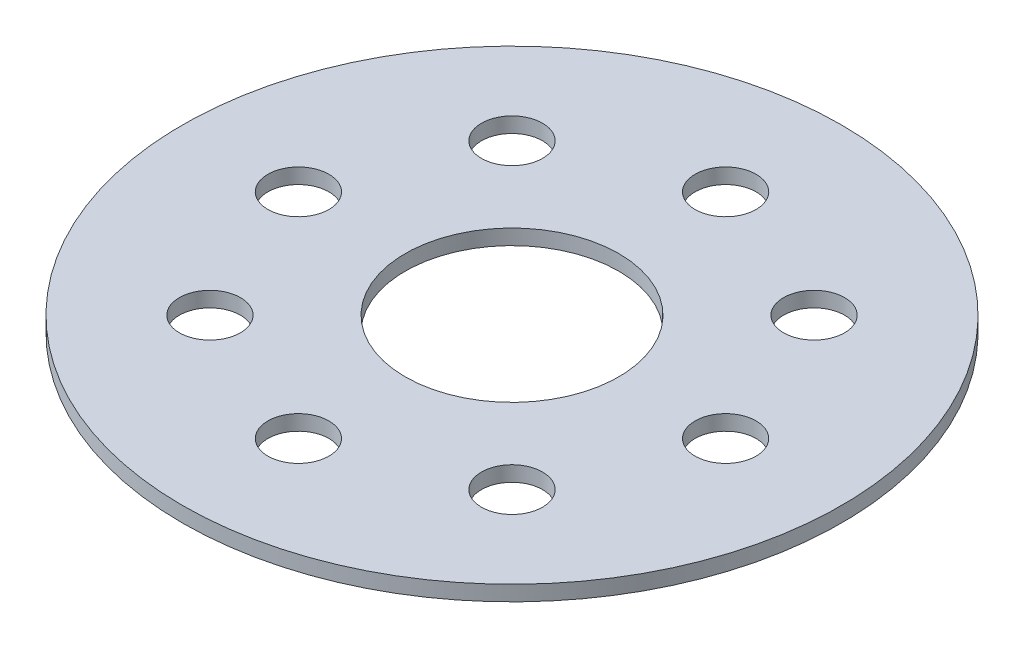
ISO-10303-21;
HEADER;
FILE_DESCRIPTION(('STEP AP214'),'2;1');
FILE_NAME('part.step','',(''),(''),'','','');
FILE_SCHEMA(('AUTOMOTIVE_DESIGN { 1 0 10303 214 1 1 1 1 }'));
ENDSEC;
DATA;
#1=APPLICATION_CONTEXT('core data for automotive mechanical design processes');
#2=APPLICATION_PROTOCOL_DEFINITION('international standard','automotive_design',2000,#1);
#3=PRODUCT_CONTEXT('',#1,'mechanical');
#4=PRODUCT('Part','Part','',(#3));
#5=PRODUCT_RELATED_PRODUCT_CATEGORY('part','',(#4));
#6=PRODUCT_DEFINITION_FORMATION('','',#4);
#7=PRODUCT_DEFINITION_CONTEXT('part definition',#1,'design');
#8=PRODUCT_DEFINITION('design','',#6,#7);
#9=PRODUCT_DEFINITION_SHAPE('','',#8);
#10=(LENGTH_UNIT() NAMED_UNIT(*) SI_UNIT(.MILLI.,.METRE.));
#11=(NAMED_UNIT(*) PLANE_ANGLE_UNIT() SI_UNIT($,.RADIAN.));
#12=(NAMED_UNIT(*) SI_UNIT($,.STERADIAN.) SOLID_ANGLE_UNIT());
#13=UNCERTAINTY_MEASURE_WITH_UNIT(LENGTH_MEASURE(1.E-05),#10,'distance_accuracy_value','');
#14=(GEOMETRIC_REPRESENTATION_CONTEXT(3) GLOBAL_UNCERTAINTY_ASSIGNED_CONTEXT((#13)) GLOBAL_UNIT_ASSIGNED_CONTEXT((#10,
#11,#12)) REPRESENTATION_CONTEXT('',''));
#15=CARTESIAN_POINT('',(0.,0.,0.));
#16=DIRECTION('',(0.,0.,1.));
#17=DIRECTION('',(1.,0.,0.));
#18=AXIS2_PLACEMENT_3D('',#15,#16,#17);
#19=CARTESIAN_POINT('',(0.,3.175,0.));
#20=DIRECTION('',(0.,1.,0.));
#21=DIRECTION('',(0.,0.,1.));
#22=AXIS2_PLACEMENT_3D('',#19,#20,#21);
#23=PLANE('',#22);
#24=CARTESIAN_POINT('',(-44.45,3.175,1.55196345511577E-13));
#25=DIRECTION('',(0.,1.,0.));
#26=DIRECTION('',(1.,0.,0.));
#27=AXIS2_PLACEMENT_3D('',#24,#25,#26);
#28=CIRCLE('',#27,6.35);
#29=CARTESIAN_POINT('',(-38.1,3.175,1.33025439009923E-13));
#30=VERTEX_POINT('',#29);
#31=EDGE_CURVE('E89',#30,#30,#28,.T.);
#32=ORIENTED_EDGE('',*,*,#31,.F.);
#33=EDGE_LOOP('',(#32));
#34=FACE_BOUND('',#33,.T.);
#35=CARTESIAN_POINT('',(-31.4308964237419,3.175,31.4308964237422));
#36=DIRECTION('',(0.,1.,0.));
#37=DIRECTION('',(0.707106781186544,0.,-0.707106781186551));
#38=AXIS2_PLACEMENT_3D('',#35,#36,#37);
#39=CIRCLE('',#38,6.35);
#40=CARTESIAN_POINT('',(-26.9407683632073,3.175,26.9407683632076));
#41=VERTEX_POINT('',#40);
#42=EDGE_CURVE('E83',#41,#41,#39,.T.);
#43=ORIENTED_EDGE('',*,*,#42,.F.);
#44=EDGE_LOOP('',(#43));
#45=FACE_BOUND('',#44,.T.);
#46=CARTESIAN_POINT('',(0.,3.175,44.45));
#47=DIRECTION('',(0.,1.,0.));
#48=DIRECTION('',(0.,0.,-1.));
#49=AXIS2_PLACEMENT_3D('',#46,#47,#48);
#50=CIRCLE('',#49,6.35);
#51=CARTESIAN_POINT('',(0.,3.175,38.1));
#52=VERTEX_POINT('',#51);
#53=EDGE_CURVE('E77',#52,#52,#50,.T.);
#54=ORIENTED_EDGE('',*,*,#53,.F.);
#55=EDGE_LOOP('',(#54));
#56=FACE_BOUND('',#55,.T.);
#57=CARTESIAN_POINT('',(31.4308964237423,3.175,31.4308964237418));
#58=DIRECTION('',(0.,1.,0.));
#59=DIRECTION('',(-0.707106781186554,0.,-0.707106781186541));
#60=AXIS2_PLACEMENT_3D('',#57,#58,#59);
#61=CIRCLE('',#60,6.35);
#62=CARTESIAN_POINT('',(26.9407683632077,3.175,26.9407683632072));
#63=VERTEX_POINT('',#62);
#64=EDGE_CURVE('E70',#63,#63,#61,.T.);
#65=ORIENTED_EDGE('',*,*,#64,.F.);
#66=EDGE_LOOP('',(#65));
#67=FACE_BOUND('',#66,.T.);
#68=CARTESIAN_POINT('',(44.45,3.175,-4.65589036534732E-13));
#69=DIRECTION('',(0.,1.,0.));
#70=DIRECTION('',(-1.,0.,0.));
#71=AXIS2_PLACEMENT_3D('',#68,#69,#70);
#72=CIRCLE('',#71,6.35);
#73=CARTESIAN_POINT('',(38.1,3.175,-3.9907631702977E-13));
#74=VERTEX_POINT('',#73);
#75=EDGE_CURVE('E100',#74,#74,#72,.T.);
#76=ORIENTED_EDGE('',*,*,#75,.F.);
#77=EDGE_LOOP('',(#76));
#78=FACE_BOUND('',#77,.T.);
#79=CARTESIAN_POINT('',(31.4308964237417,3.175,-31.4308964237424));
#80=DIRECTION('',(0.,1.,0.));
#81=DIRECTION('',(-0.707106781186539,0.,0.707106781186556));
#82=AXIS2_PLACEMENT_3D('',#79,#80,#81);
#83=CIRCLE('',#82,6.35);
#84=CARTESIAN_POINT('',(26.9407683632071,3.175,-26.9407683632078));
#85=VERTEX_POINT('',#84);
#86=EDGE_CURVE('E94',#85,#85,#83,.T.);
#87=ORIENTED_EDGE('',*,*,#86,.F.);
#88=EDGE_LOOP('',(#87));
#89=FACE_BOUND('',#88,.T.);
#90=CARTESIAN_POINT('',(-31.4308964237421,3.175,-31.430896423742));
#91=DIRECTION('',(0.,1.,0.));
#92=DIRECTION('',(0.707106781186549,0.,0.707106781186546));
#93=AXIS2_PLACEMENT_3D('',#90,#91,#92);
#94=CIRCLE('',#93,6.35);
#95=CARTESIAN_POINT('',(-26.9407683632075,3.175,-26.9407683632074));
#96=VERTEX_POINT('',#95);
#97=EDGE_CURVE('E64',#96,#96,#94,.T.);
#98=ORIENTED_EDGE('',*,*,#97,.F.);
#99=EDGE_LOOP('',(#98));
#100=FACE_BOUND('',#99,.T.);
#101=CARTESIAN_POINT('',(0.,3.175,-44.45));
#102=DIRECTION('',(0.,1.,0.));
#103=DIRECTION('',(0.,0.,1.));
#104=AXIS2_PLACEMENT_3D('',#101,#102,#103);
#105=CIRCLE('',#104,6.35);
#106=CARTESIAN_POINT('',(0.,3.175,-38.1));
#107=VERTEX_POINT('',#106);
#108=EDGE_CURVE('E58',#107,#107,#105,.T.);
#109=ORIENTED_EDGE('',*,*,#108,.F.);
#110=EDGE_LOOP('',(#109));
#111=FACE_BOUND('',#110,.T.);
#112=CARTESIAN_POINT('',(0.,3.175,0.));
#113=DIRECTION('',(0.,1.,0.));
#114=DIRECTION('',(0.,0.,1.));
#115=AXIS2_PLACEMENT_3D('',#112,#113,#114);
#116=CIRCLE('',#115,68.58);
#117=CARTESIAN_POINT('',(0.,3.175,68.58));
#118=VERTEX_POINT('',#117);
#119=EDGE_CURVE('E10',#118,#118,#116,.T.);
#120=ORIENTED_EDGE('',*,*,#119,.T.);
#121=EDGE_LOOP('',(#120));
#122=FACE_BOUND('',#121,.T.);
#123=CARTESIAN_POINT('',(0.,3.175,0.));
#124=DIRECTION('',(0.,1.,0.));
#125=DIRECTION('',(0.,0.,1.));
#126=AXIS2_PLACEMENT_3D('',#123,#124,#125);
#127=CIRCLE('',#126,22.225);
#128=CARTESIAN_POINT('',(0.,3.175,22.225));
#129=VERTEX_POINT('',#128);
#130=EDGE_CURVE('E50',#129,#129,#127,.T.);
#131=ORIENTED_EDGE('',*,*,#130,.F.);
#132=EDGE_LOOP('',(#131));
#133=FACE_BOUND('',#132,.T.);
#134=ADVANCED_FACE('F39',(#34,#45,#56,#67,#78,#89,#100,#111,#122,#133),#23,.T.);
#135=CARTESIAN_POINT('',(0.,0.,0.));
#136=DIRECTION('',(0.,1.,0.));
#137=DIRECTION('',(0.,0.,1.));
#138=AXIS2_PLACEMENT_3D('',#135,#136,#137);
#139=PLANE('',#138);
#140=CARTESIAN_POINT('',(-44.45,0.,1.55196345511577E-13));
#141=DIRECTION('',(0.,1.,0.));
#142=DIRECTION('',(1.,0.,0.));
#143=AXIS2_PLACEMENT_3D('',#140,#141,#142);
#144=CIRCLE('',#143,6.35);
#145=CARTESIAN_POINT('',(-38.1,0.,1.33025439009923E-13));
#146=VERTEX_POINT('',#145);
#147=EDGE_CURVE('E67',#146,#146,#144,.T.);
#148=ORIENTED_EDGE('',*,*,#147,.T.);
#149=EDGE_LOOP('',(#148));
#150=FACE_BOUND('',#149,.T.);
#151=CARTESIAN_POINT('',(-31.4308964237419,0.,31.4308964237422));
#152=DIRECTION('',(0.,1.,0.));
#153=DIRECTION('',(0.707106781186544,0.,-0.707106781186551));
#154=AXIS2_PLACEMENT_3D('',#151,#152,#153);
#155=CIRCLE('',#154,6.35);
#156=CARTESIAN_POINT('',(-26.9407683632073,0.,26.9407683632076));
#157=VERTEX_POINT('',#156);
#158=EDGE_CURVE('E86',#157,#157,#155,.T.);
#159=ORIENTED_EDGE('',*,*,#158,.T.);
#160=EDGE_LOOP('',(#159));
#161=FACE_BOUND('',#160,.T.);
#162=CARTESIAN_POINT('',(0.,0.,44.45));
#163=DIRECTION('',(0.,1.,0.));
#164=DIRECTION('',(0.,0.,-1.));
#165=AXIS2_PLACEMENT_3D('',#162,#163,#164);
#166=CIRCLE('',#165,6.35);
#167=CARTESIAN_POINT('',(0.,0.,38.1));
#168=VERTEX_POINT('',#167);
#169=EDGE_CURVE('E80',#168,#168,#166,.T.);
#170=ORIENTED_EDGE('',*,*,#169,.T.);
#171=EDGE_LOOP('',(#170));
#172=FACE_BOUND('',#171,.T.);
#173=CARTESIAN_POINT('',(31.4308964237423,0.,31.4308964237418));
#174=DIRECTION('',(0.,1.,0.));
#175=DIRECTION('',(-0.707106781186554,0.,-0.707106781186541));
#176=AXIS2_PLACEMENT_3D('',#173,#174,#175);
#177=CIRCLE('',#176,6.35);
#178=CARTESIAN_POINT('',(26.9407683632077,0.,26.9407683632072));
#179=VERTEX_POINT('',#178);
#180=EDGE_CURVE('E73',#179,#179,#177,.T.);
#181=ORIENTED_EDGE('',*,*,#180,.T.);
#182=EDGE_LOOP('',(#181));
#183=FACE_BOUND('',#182,.T.);
#184=CARTESIAN_POINT('',(44.45,0.,-4.65589036534732E-13));
#185=DIRECTION('',(0.,1.,0.));
#186=DIRECTION('',(-1.,0.,0.));
#187=AXIS2_PLACEMENT_3D('',#184,#185,#186);
#188=CIRCLE('',#187,6.35);
#189=CARTESIAN_POINT('',(38.1,0.,-3.9907631702977E-13));
#190=VERTEX_POINT('',#189);
#191=EDGE_CURVE('E74',#190,#190,#188,.T.);
#192=ORIENTED_EDGE('',*,*,#191,.T.);
#193=EDGE_LOOP('',(#192));
#194=FACE_BOUND('',#193,.T.);
#195=CARTESIAN_POINT('',(31.4308964237417,0.,-31.4308964237424));
#196=DIRECTION('',(0.,1.,0.));
#197=DIRECTION('',(-0.707106781186539,0.,0.707106781186556));
#198=AXIS2_PLACEMENT_3D('',#195,#196,#197);
#199=CIRCLE('',#198,6.35);
#200=CARTESIAN_POINT('',(26.9407683632071,0.,-26.9407683632078));
#201=VERTEX_POINT('',#200);
#202=EDGE_CURVE('E97',#201,#201,#199,.T.);
#203=ORIENTED_EDGE('',*,*,#202,.T.);
#204=EDGE_LOOP('',(#203));
#205=FACE_BOUND('',#204,.T.);
#206=CARTESIAN_POINT('',(-31.4308964237421,0.,-31.430896423742));
#207=DIRECTION('',(0.,1.,0.));
#208=DIRECTION('',(0.707106781186549,0.,0.707106781186546));
#209=AXIS2_PLACEMENT_3D('',#206,#207,#208);
#210=CIRCLE('',#209,6.35);
#211=CARTESIAN_POINT('',(-26.9407683632075,0.,-26.9407683632074));
#212=VERTEX_POINT('',#211);
#213=EDGE_CURVE('E61',#212,#212,#210,.T.);
#214=ORIENTED_EDGE('',*,*,#213,.T.);
#215=EDGE_LOOP('',(#214));
#216=FACE_BOUND('',#215,.T.);
#217=CARTESIAN_POINT('',(0.,0.,-44.45));
#218=DIRECTION('',(0.,1.,0.));
#219=DIRECTION('',(0.,0.,1.));
#220=AXIS2_PLACEMENT_3D('',#217,#218,#219);
#221=CIRCLE('',#220,6.35);
#222=CARTESIAN_POINT('',(0.,0.,-38.1));
#223=VERTEX_POINT('',#222);
#224=EDGE_CURVE('E55',#223,#223,#221,.T.);
#225=ORIENTED_EDGE('',*,*,#224,.T.);
#226=EDGE_LOOP('',(#225));
#227=FACE_BOUND('',#226,.T.);
#228=CARTESIAN_POINT('',(0.,0.,0.));
#229=DIRECTION('',(0.,1.,0.));
#230=DIRECTION('',(0.,0.,1.));
#231=AXIS2_PLACEMENT_3D('',#228,#229,#230);
#232=CIRCLE('',#231,68.58);
#233=CARTESIAN_POINT('',(0.,0.,68.58));
#234=VERTEX_POINT('',#233);
#235=EDGE_CURVE('E43',#234,#234,#232,.T.);
#236=ORIENTED_EDGE('',*,*,#235,.F.);
#237=EDGE_LOOP('',(#236));
#238=FACE_BOUND('',#237,.T.);
#239=CARTESIAN_POINT('',(0.,0.,0.));
#240=DIRECTION('',(0.,1.,0.));
#241=DIRECTION('',(0.,0.,1.));
#242=AXIS2_PLACEMENT_3D('',#239,#240,#241);
#243=CIRCLE('',#242,22.225);
#244=CARTESIAN_POINT('',(0.,0.,22.225));
#245=VERTEX_POINT('',#244);
#246=EDGE_CURVE('E52',#245,#245,#243,.T.);
#247=ORIENTED_EDGE('',*,*,#246,.T.);
#248=EDGE_LOOP('',(#247));
#249=FACE_BOUND('',#248,.T.);
#250=ADVANCED_FACE('F106',(#150,#161,#172,#183,#194,#205,#216,#227,#238,#249),#139,.F.);
#251=CARTESIAN_POINT('',(0.,3.175,0.));
#252=DIRECTION('',(0.,-1.,0.));
#253=DIRECTION('',(0.,0.,-1.));
#254=AXIS2_PLACEMENT_3D('',#251,#252,#253);
#255=CYLINDRICAL_SURFACE('',#254,68.58);
#256=ORIENTED_EDGE('',*,*,#119,.F.);
#257=EDGE_LOOP('',(#256));
#258=FACE_BOUND('',#257,.T.);
#259=ORIENTED_EDGE('',*,*,#235,.T.);
#260=EDGE_LOOP('',(#259));
#261=FACE_BOUND('',#260,.T.);
#262=ADVANCED_FACE('F41',(#258,#261),#255,.T.);
#263=CARTESIAN_POINT('',(0.,3.175,0.));
#264=DIRECTION('',(0.,-1.,0.));
#265=DIRECTION('',(0.,0.,-1.));
#266=AXIS2_PLACEMENT_3D('',#263,#264,#265);
#267=CYLINDRICAL_SURFACE('',#266,22.225);
#268=ORIENTED_EDGE('',*,*,#130,.T.);
#269=EDGE_LOOP('',(#268));
#270=FACE_BOUND('',#269,.T.);
#271=ORIENTED_EDGE('',*,*,#246,.F.);
#272=EDGE_LOOP('',(#271));
#273=FACE_BOUND('',#272,.T.);
#274=ADVANCED_FACE('F129',(#270,#273),#267,.F.);
#275=CARTESIAN_POINT('',(0.,0.,-44.45));
#276=DIRECTION('',(0.,1.,0.));
#277=DIRECTION('',(0.,0.,1.));
#278=AXIS2_PLACEMENT_3D('',#275,#276,#277);
#279=CYLINDRICAL_SURFACE('',#278,6.35);
#280=ORIENTED_EDGE('',*,*,#224,.F.);
#281=EDGE_LOOP('',(#280));
#282=FACE_BOUND('',#281,.T.);
#283=ORIENTED_EDGE('',*,*,#108,.T.);
#284=EDGE_LOOP('',(#283));
#285=FACE_BOUND('',#284,.T.);
#286=ADVANCED_FACE('F132',(#282,#285),#279,.F.);
#287=CARTESIAN_POINT('',(-31.4308964237421,0.,-31.430896423742));
#288=DIRECTION('',(0.,1.,0.));
#289=DIRECTION('',(0.,0.,1.));
#290=AXIS2_PLACEMENT_3D('',#287,#288,#289);
#291=CYLINDRICAL_SURFACE('',#290,6.35);
#292=ORIENTED_EDGE('',*,*,#213,.F.);
#293=EDGE_LOOP('',(#292));
#294=FACE_BOUND('',#293,.T.);
#295=ORIENTED_EDGE('',*,*,#97,.T.);
#296=EDGE_LOOP('',(#295));
#297=FACE_BOUND('',#296,.T.);
#298=ADVANCED_FACE('F146',(#294,#297),#291,.F.);
#299=CARTESIAN_POINT('',(31.4308964237417,0.,-31.4308964237424));
#300=DIRECTION('',(0.,1.,0.));
#301=DIRECTION('',(0.,0.,1.));
#302=AXIS2_PLACEMENT_3D('',#299,#300,#301);
#303=CYLINDRICAL_SURFACE('',#302,6.35);
#304=ORIENTED_EDGE('',*,*,#202,.F.);
#305=EDGE_LOOP('',(#304));
#306=FACE_BOUND('',#305,.T.);
#307=ORIENTED_EDGE('',*,*,#86,.T.);
#308=EDGE_LOOP('',(#307));
#309=FACE_BOUND('',#308,.T.);
#310=ADVANCED_FACE('F113',(#306,#309),#303,.F.);
#311=CARTESIAN_POINT('',(44.45,0.,-4.65589036534732E-13));
#312=DIRECTION('',(0.,1.,0.));
#313=DIRECTION('',(0.,0.,1.));
#314=AXIS2_PLACEMENT_3D('',#311,#312,#313);
#315=CYLINDRICAL_SURFACE('',#314,6.35);
#316=ORIENTED_EDGE('',*,*,#191,.F.);
#317=EDGE_LOOP('',(#316));
#318=FACE_BOUND('',#317,.T.);
#319=ORIENTED_EDGE('',*,*,#75,.T.);
#320=EDGE_LOOP('',(#319));
#321=FACE_BOUND('',#320,.T.);
#322=ADVANCED_FACE('F109',(#318,#321),#315,.F.);
#323=CARTESIAN_POINT('',(31.4308964237423,0.,31.4308964237418));
#324=DIRECTION('',(0.,1.,0.));
#325=DIRECTION('',(0.,0.,1.));
#326=AXIS2_PLACEMENT_3D('',#323,#324,#325);
#327=CYLINDRICAL_SURFACE('',#326,6.35);
#328=ORIENTED_EDGE('',*,*,#180,.F.);
#329=EDGE_LOOP('',(#328));
#330=FACE_BOUND('',#329,.T.);
#331=ORIENTED_EDGE('',*,*,#64,.T.);
#332=EDGE_LOOP('',(#331));
#333=FACE_BOUND('',#332,.T.);
#334=ADVANCED_FACE('F112',(#330,#333),#327,.F.);
#335=CARTESIAN_POINT('',(0.,0.,44.45));
#336=DIRECTION('',(0.,1.,0.));
#337=DIRECTION('',(0.,0.,1.));
#338=AXIS2_PLACEMENT_3D('',#335,#336,#337);
#339=CYLINDRICAL_SURFACE('',#338,6.35);
#340=ORIENTED_EDGE('',*,*,#169,.F.);
#341=EDGE_LOOP('',(#340));
#342=FACE_BOUND('',#341,.T.);
#343=ORIENTED_EDGE('',*,*,#53,.T.);
#344=EDGE_LOOP('',(#343));
#345=FACE_BOUND('',#344,.T.);
#346=ADVANCED_FACE('F153',(#342,#345),#339,.F.);
#347=CARTESIAN_POINT('',(-31.4308964237419,0.,31.4308964237422));
#348=DIRECTION('',(0.,1.,0.));
#349=DIRECTION('',(0.,0.,1.));
#350=AXIS2_PLACEMENT_3D('',#347,#348,#349);
#351=CYLINDRICAL_SURFACE('',#350,6.35);
#352=ORIENTED_EDGE('',*,*,#158,.F.);
#353=EDGE_LOOP('',(#352));
#354=FACE_BOUND('',#353,.T.);
#355=ORIENTED_EDGE('',*,*,#42,.T.);
#356=EDGE_LOOP('',(#355));
#357=FACE_BOUND('',#356,.T.);
#358=ADVANCED_FACE('F157',(#354,#357),#351,.F.);
#359=CARTESIAN_POINT('',(-44.45,0.,1.55196345511577E-13));
#360=DIRECTION('',(0.,1.,0.));
#361=DIRECTION('',(0.,0.,1.));
#362=AXIS2_PLACEMENT_3D('',#359,#360,#361);
#363=CYLINDRICAL_SURFACE('',#362,6.35);
#364=ORIENTED_EDGE('',*,*,#147,.F.);
#365=EDGE_LOOP('',(#364));
#366=FACE_BOUND('',#365,.T.);
#367=ORIENTED_EDGE('',*,*,#31,.T.);
#368=EDGE_LOOP('',(#367));
#369=FACE_BOUND('',#368,.T.);
#370=ADVANCED_FACE('F161',(#366,#369),#363,.F.);
#371=CLOSED_SHELL('',(#134,#250,#262,#274,#286,#298,#310,#322,#334,#346,#358,#370));
#372=MANIFOLD_SOLID_BREP('B2',#371);
#373=ADVANCED_BREP_SHAPE_REPRESENTATION('',(#18,#372),#14);
#374=SHAPE_DEFINITION_REPRESENTATION(#9,#373);
ENDSEC;
END-ISO-10303-21;
